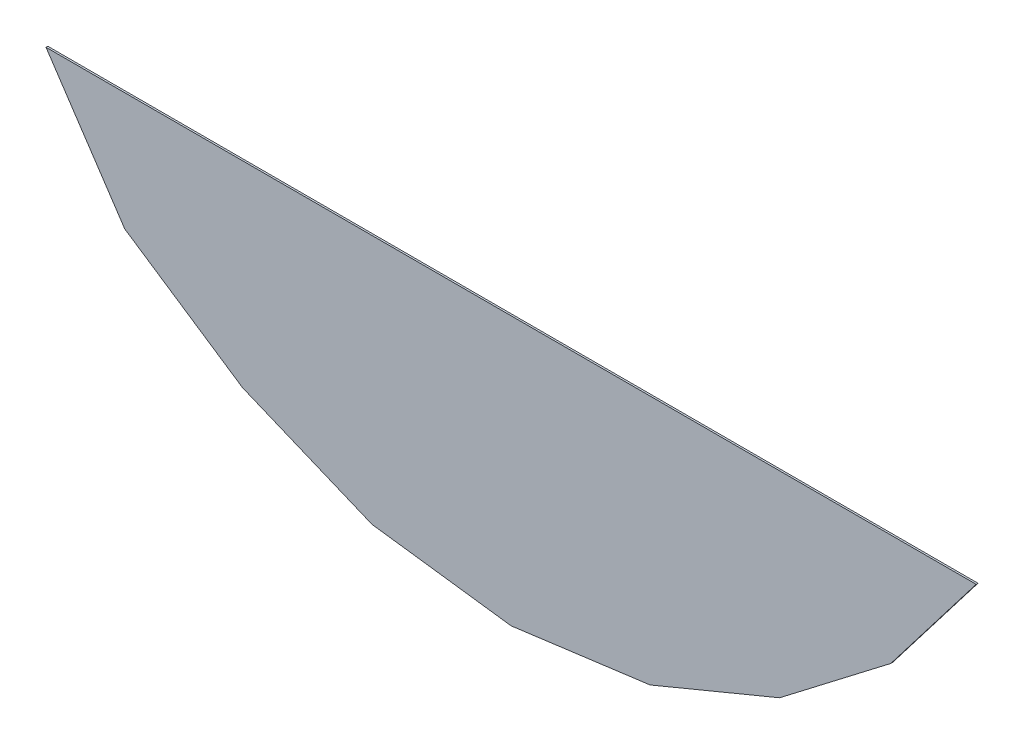
ISO-10303-21;
HEADER;
FILE_DESCRIPTION(('STEP AP214'),'2;1');
FILE_NAME('part.step','',(''),(''),'','','');
FILE_SCHEMA(('AUTOMOTIVE_DESIGN { 1 0 10303 214 1 1 1 1 }'));
ENDSEC;
DATA;
#1=APPLICATION_CONTEXT('core data for automotive mechanical design processes');
#2=APPLICATION_PROTOCOL_DEFINITION('international standard','automotive_design',2000,#1);
#3=PRODUCT_CONTEXT('',#1,'mechanical');
#4=PRODUCT('Part','Part','',(#3));
#5=PRODUCT_RELATED_PRODUCT_CATEGORY('part','',(#4));
#6=PRODUCT_DEFINITION_FORMATION('','',#4);
#7=PRODUCT_DEFINITION_CONTEXT('part definition',#1,'design');
#8=PRODUCT_DEFINITION('design','',#6,#7);
#9=PRODUCT_DEFINITION_SHAPE('','',#8);
#10=(LENGTH_UNIT() NAMED_UNIT(*) SI_UNIT(.MILLI.,.METRE.));
#11=(NAMED_UNIT(*) PLANE_ANGLE_UNIT() SI_UNIT($,.RADIAN.));
#12=(NAMED_UNIT(*) SI_UNIT($,.STERADIAN.) SOLID_ANGLE_UNIT());
#13=UNCERTAINTY_MEASURE_WITH_UNIT(LENGTH_MEASURE(1.E-05),#10,'distance_accuracy_value','');
#14=(GEOMETRIC_REPRESENTATION_CONTEXT(3) GLOBAL_UNCERTAINTY_ASSIGNED_CONTEXT((#13)) GLOBAL_UNIT_ASSIGNED_CONTEXT((#10,
#11,#12)) REPRESENTATION_CONTEXT('',''));
#15=CARTESIAN_POINT('',(0.,0.,0.));
#16=DIRECTION('',(0.,0.,1.));
#17=DIRECTION('',(1.,0.,0.));
#18=AXIS2_PLACEMENT_3D('',#15,#16,#17);
#19=CARTESIAN_POINT('',(-2.55477772,-4.28920148,3.89999982));
#20=DIRECTION('',(0.,0.,1.));
#21=DIRECTION('',(1.,0.,0.));
#22=AXIS2_PLACEMENT_3D('',#19,#20,#21);
#23=PLANE('',#22);
#24=DIRECTION('',(0.793354187267815,0.608760325205762,0.));
#25=VECTOR('',#24,1.);
#26=CARTESIAN_POINT('',(1.47499832000001,-5.36897580000001,3.89999982));
#27=LINE('',#26,#25);
#28=CARTESIAN_POINT('',(1.47499832000001,-5.36897580000002,3.89999982));
#29=VERTEX_POINT('',#28);
#30=CARTESIAN_POINT('',(2.08596230000003,-4.90016800000002,3.89999982));
#31=VERTEX_POINT('',#30);
#32=EDGE_CURVE('E116',#29,#31,#27,.T.);
#33=ORIENTED_EDGE('',*,*,#32,.F.);
#34=DIRECTION('',(0.923879753352726,0.382682899206258,0.));
#35=VECTOR('',#34,1.);
#36=CARTESIAN_POINT('',(0.763513839999964,-5.66368183999992,3.89999982));
#37=LINE('',#36,#35);
#38=CARTESIAN_POINT('',(0.763513839999939,-5.66368183999988,3.89999982));
#39=VERTEX_POINT('',#38);
#40=EDGE_CURVE('E114',#39,#29,#37,.T.);
#41=ORIENTED_EDGE('',*,*,#40,.F.);
#42=DIRECTION('',(0.991445008976763,0.130525071059419,0.));
#43=VECTOR('',#42,1.);
#44=CARTESIAN_POINT('',(-2.54000000806526E-06,-5.76419979999992,3.89999982));
#45=LINE('',#44,#43);
#46=CARTESIAN_POINT('',(-2.54000002030564E-06,-5.76419979999987,3.89999982));
#47=VERTEX_POINT('',#46);
#48=EDGE_CURVE('E112',#47,#39,#45,.T.);
#49=ORIENTED_EDGE('',*,*,#48,.F.);
#50=DIRECTION('',(0.991445008976791,-0.130525071059209,0.));
#51=VECTOR('',#50,1.);
#52=CARTESIAN_POINT('',(-0.763518920000012,-5.66368184000008,3.89999982));
#53=LINE('',#52,#51);
#54=CARTESIAN_POINT('',(-0.763518920000012,-5.66368184000013,3.89999982));
#55=VERTEX_POINT('',#54);
#56=EDGE_CURVE('E108',#55,#47,#53,.T.);
#57=ORIENTED_EDGE('',*,*,#56,.F.);
#58=DIRECTION('',(0.923879753352681,-0.382682899206366,0.));
#59=VECTOR('',#58,1.);
#60=CARTESIAN_POINT('',(-1.47500340000004,-5.36897580000008,3.89999982));
#61=LINE('',#60,#59);
#62=CARTESIAN_POINT('',(-1.47500340000005,-5.36897580000012,3.89999982));
#63=VERTEX_POINT('',#62);
#64=EDGE_CURVE('E107',#63,#55,#61,.T.);
#65=ORIENTED_EDGE('',*,*,#64,.F.);
#66=DIRECTION('',(0.831757058894327,-0.555139797690148,0.));
#67=VECTOR('',#66,1.);
#68=CARTESIAN_POINT('',(-2.12257131999998,-4.93676939999997,3.89999982));
#69=LINE('',#68,#67);
#70=CARTESIAN_POINT('',(-2.12257131999997,-4.93676939999995,3.89999982));
#71=VERTEX_POINT('',#70);
#72=EDGE_CURVE('E85',#71,#63,#69,.T.);
#73=ORIENTED_EDGE('',*,*,#72,.F.);
#74=DIRECTION('',(0.555139797690141,-0.831757058894332,0.));
#75=VECTOR('',#74,1.);
#76=CARTESIAN_POINT('',(-2.55477772000007,-4.28920148000005,3.89999982));
#77=LINE('',#76,#75);
#78=CARTESIAN_POINT('',(-2.5547777200001,-4.28920148000002,3.89999982));
#79=VERTEX_POINT('',#78);
#80=EDGE_CURVE('E20',#79,#71,#77,.T.);
#81=ORIENTED_EDGE('',*,*,#80,.F.);
#82=DIRECTION('',(1.,0.,0.));
#83=VECTOR('',#82,1.);
#84=CARTESIAN_POINT('',(-2.55477772,-4.28920148,3.89999982));
#85=LINE('',#84,#83);
#86=CARTESIAN_POINT('',(2.55477264,-4.28920148,3.89999982));
#87=VERTEX_POINT('',#86);
#88=EDGE_CURVE('E123',#87,#79,#85,.F.);
#89=ORIENTED_EDGE('',*,*,#88,.F.);
#90=DIRECTION('',(0.608760808228314,0.793353816632409,0.));
#91=VECTOR('',#90,1.);
#92=CARTESIAN_POINT('',(2.55477264,-4.28920148,3.89999982));
#93=LINE('',#92,#91);
#94=EDGE_CURVE('E118',#31,#87,#93,.T.);
#95=ORIENTED_EDGE('',*,*,#94,.F.);
#96=EDGE_LOOP('',(#33,#41,#49,#57,#65,#73,#81,#89,#95));
#97=FACE_BOUND('',#96,.T.);
#98=ADVANCED_FACE('F17',(#97),#23,.F.);
#99=CARTESIAN_POINT('',(2.55477264,-4.28920148,3.89999982));
#100=DIRECTION('',(0.793353816632409,-0.608760808228314,0.));
#101=DIRECTION('',(0.608760808228314,0.793353816632409,0.));
#102=AXIS2_PLACEMENT_3D('',#99,#100,#101);
#103=PLANE('',#102);
#104=DIRECTION('',(0.,0.,1.));
#105=VECTOR('',#104,1.);
#106=CARTESIAN_POINT('',(2.55477264,-4.28920148,3.89999982));
#107=LINE('',#106,#105);
#108=CARTESIAN_POINT('',(2.55477264,-4.28920148,3.9099998));
#109=VERTEX_POINT('',#108);
#110=EDGE_CURVE('E120',#109,#87,#107,.F.);
#111=ORIENTED_EDGE('',*,*,#110,.F.);
#112=DIRECTION('',(0.608760808228391,0.79335381663235,0.));
#113=VECTOR('',#112,1.);
#114=CARTESIAN_POINT('',(2.08596230000002,-4.90016800000001,3.9099998));
#115=LINE('',#114,#113);
#116=CARTESIAN_POINT('',(2.08596230000005,-4.90016800000003,3.9099998));
#117=VERTEX_POINT('',#116);
#118=EDGE_CURVE('E140',#117,#109,#115,.T.);
#119=ORIENTED_EDGE('',*,*,#118,.F.);
#120=DIRECTION('',(0.,0.,1.));
#121=VECTOR('',#120,1.);
#122=CARTESIAN_POINT('',(2.08596230000001,-4.90016799999999,3.89999982));
#123=LINE('',#122,#121);
#124=EDGE_CURVE('E137',#31,#117,#123,.T.);
#125=ORIENTED_EDGE('',*,*,#124,.F.);
#126=ORIENTED_EDGE('',*,*,#94,.T.);
#127=EDGE_LOOP('',(#111,#119,#125,#126));
#128=FACE_BOUND('',#127,.T.);
#129=ADVANCED_FACE('F171',(#128),#103,.T.);
#130=CARTESIAN_POINT('',(-2.55477772,-4.28920148,3.89999982));
#131=DIRECTION('',(0.,1.,0.));
#132=DIRECTION('',(0.,0.,1.));
#133=AXIS2_PLACEMENT_3D('',#130,#131,#132);
#134=PLANE('',#133);
#135=DIRECTION('',(0.,0.,1.));
#136=VECTOR('',#135,1.);
#137=CARTESIAN_POINT('',(-2.55477772000014,-4.2892014800001,3.89999982));
#138=LINE('',#137,#136);
#139=CARTESIAN_POINT('',(-2.5547777200001,-4.28920148000002,3.9099998));
#140=VERTEX_POINT('',#139);
#141=EDGE_CURVE('E94',#140,#79,#138,.F.);
#142=ORIENTED_EDGE('',*,*,#141,.F.);
#143=DIRECTION('',(1.,0.,0.));
#144=VECTOR('',#143,1.);
#145=CARTESIAN_POINT('',(-2.55477772,-4.28920148,3.9099998));
#146=LINE('',#145,#144);
#147=EDGE_CURVE('E143',#109,#140,#146,.F.);
#148=ORIENTED_EDGE('',*,*,#147,.F.);
#149=ORIENTED_EDGE('',*,*,#110,.T.);
#150=ORIENTED_EDGE('',*,*,#88,.T.);
#151=EDGE_LOOP('',(#142,#148,#149,#150));
#152=FACE_BOUND('',#151,.T.);
#153=ADVANCED_FACE('F174',(#152),#134,.T.);
#154=CARTESIAN_POINT('',(-2.12257132,-4.9367694,3.89999982));
#155=DIRECTION('',(-0.831757058894295,-0.555139797690197,0.));
#156=DIRECTION('',(0.555139797690197,-0.831757058894295,0.));
#157=AXIS2_PLACEMENT_3D('',#154,#155,#156);
#158=PLANE('',#157);
#159=DIRECTION('',(0.,0.,1.));
#160=VECTOR('',#159,1.);
#161=CARTESIAN_POINT('',(-2.12257131999991,-4.93676939999986,3.89999982));
#162=LINE('',#161,#160);
#163=CARTESIAN_POINT('',(-2.12257131999998,-4.93676939999995,3.9099998));
#164=VERTEX_POINT('',#163);
#165=EDGE_CURVE('E92',#164,#71,#162,.F.);
#166=ORIENTED_EDGE('',*,*,#165,.F.);
#167=DIRECTION('',(0.555139797690141,-0.831757058894332,0.));
#168=VECTOR('',#167,1.);
#169=CARTESIAN_POINT('',(-2.55477772000007,-4.28920148000005,3.9099998));
#170=LINE('',#169,#168);
#171=EDGE_CURVE('E146',#140,#164,#170,.T.);
#172=ORIENTED_EDGE('',*,*,#171,.F.);
#173=ORIENTED_EDGE('',*,*,#141,.T.);
#174=ORIENTED_EDGE('',*,*,#80,.T.);
#175=EDGE_LOOP('',(#166,#172,#173,#174));
#176=FACE_BOUND('',#175,.T.);
#177=ADVANCED_FACE('F90',(#176),#158,.T.);
#178=CARTESIAN_POINT('',(-1.4750034,-5.3689758,3.89999982));
#179=DIRECTION('',(-0.555139797690197,-0.831757058894295,0.));
#180=DIRECTION('',(0.831757058894295,-0.555139797690197,0.));
#181=AXIS2_PLACEMENT_3D('',#178,#179,#180);
#182=PLANE('',#181);
#183=DIRECTION('',(0.,0.,1.));
#184=VECTOR('',#183,1.);
#185=CARTESIAN_POINT('',(-1.47500340000015,-5.36897580000034,3.89999982));
#186=LINE('',#185,#184);
#187=CARTESIAN_POINT('',(-1.47500340000004,-5.36897580000011,3.9099998));
#188=VERTEX_POINT('',#187);
#189=EDGE_CURVE('E102',#188,#63,#186,.F.);
#190=ORIENTED_EDGE('',*,*,#189,.F.);
#191=DIRECTION('',(0.831757058894327,-0.555139797690148,0.));
#192=VECTOR('',#191,1.);
#193=CARTESIAN_POINT('',(-2.12257131999998,-4.93676939999997,3.9099998));
#194=LINE('',#193,#192);
#195=EDGE_CURVE('E100',#164,#188,#194,.T.);
#196=ORIENTED_EDGE('',*,*,#195,.F.);
#197=ORIENTED_EDGE('',*,*,#165,.T.);
#198=ORIENTED_EDGE('',*,*,#72,.T.);
#199=EDGE_LOOP('',(#190,#196,#197,#198));
#200=FACE_BOUND('',#199,.T.);
#201=ADVANCED_FACE('F98',(#200),#182,.T.);
#202=CARTESIAN_POINT('',(-0.76351892,-5.66368184,3.89999982));
#203=DIRECTION('',(-0.382682899205941,-0.923879753352857,0.));
#204=DIRECTION('',(0.923879753352857,-0.382682899205941,0.));
#205=AXIS2_PLACEMENT_3D('',#202,#203,#204);
#206=PLANE('',#205);
#207=DIRECTION('',(0.,0.,1.));
#208=VECTOR('',#207,1.);
#209=CARTESIAN_POINT('',(-0.763518920000046,-5.66368184000034,3.89999982));
#210=LINE('',#209,#208);
#211=CARTESIAN_POINT('',(-0.763518920000005,-5.66368184000011,3.9099998));
#212=VERTEX_POINT('',#211);
#213=EDGE_CURVE('E127',#212,#55,#210,.F.);
#214=ORIENTED_EDGE('',*,*,#213,.F.);
#215=DIRECTION('',(0.923879753352681,-0.382682899206366,0.));
#216=VECTOR('',#215,1.);
#217=CARTESIAN_POINT('',(-1.47500340000004,-5.36897580000008,3.9099998));
#218=LINE('',#217,#216);
#219=EDGE_CURVE('E149',#188,#212,#218,.T.);
#220=ORIENTED_EDGE('',*,*,#219,.F.);
#221=ORIENTED_EDGE('',*,*,#189,.T.);
#222=ORIENTED_EDGE('',*,*,#64,.T.);
#223=EDGE_LOOP('',(#214,#220,#221,#222));
#224=FACE_BOUND('',#223,.T.);
#225=ADVANCED_FACE('F198',(#224),#206,.T.);
#226=CARTESIAN_POINT('',(-2.539999996998E-06,-5.7641998,3.89999982));
#227=DIRECTION('',(-0.130525071058976,-0.991445008976821,0.));
#228=DIRECTION('',(0.991445008976821,-0.130525071058976,0.));
#229=AXIS2_PLACEMENT_3D('',#226,#227,#228);
#230=PLANE('',#229);
#231=DIRECTION('',(0.,0.,1.));
#232=VECTOR('',#231,1.);
#233=CARTESIAN_POINT('',(-2.54000004210921E-06,-5.76419979999966,3.89999982));
#234=LINE('',#233,#232);
#235=CARTESIAN_POINT('',(-2.54000002226133E-06,-5.76419979999989,3.9099998));
#236=VERTEX_POINT('',#235);
#237=EDGE_CURVE('E130',#236,#47,#234,.F.);
#238=ORIENTED_EDGE('',*,*,#237,.F.);
#239=DIRECTION('',(0.991445008976791,-0.130525071059209,0.));
#240=VECTOR('',#239,1.);
#241=CARTESIAN_POINT('',(-0.763518920000012,-5.66368184000008,3.9099998));
#242=LINE('',#241,#240);
#243=EDGE_CURVE('E152',#212,#236,#242,.T.);
#244=ORIENTED_EDGE('',*,*,#243,.F.);
#245=ORIENTED_EDGE('',*,*,#213,.T.);
#246=ORIENTED_EDGE('',*,*,#56,.T.);
#247=EDGE_LOOP('',(#238,#244,#245,#246));
#248=FACE_BOUND('',#247,.T.);
#249=ADVANCED_FACE('F195',(#248),#230,.T.);
#250=CARTESIAN_POINT('',(0.76351384,-5.66368184,3.89999982));
#251=DIRECTION('',(0.130525071058976,-0.991445008976821,0.));
#252=DIRECTION('',(0.991445008976821,0.130525071058976,0.));
#253=AXIS2_PLACEMENT_3D('',#250,#251,#252);
#254=PLANE('',#253);
#255=DIRECTION('',(0.,0.,1.));
#256=VECTOR('',#255,1.);
#257=CARTESIAN_POINT('',(0.763513839999858,-5.66368183999966,3.89999982));
#258=LINE('',#257,#256);
#259=CARTESIAN_POINT('',(0.763513839999943,-5.6636818399999,3.9099998));
#260=VERTEX_POINT('',#259);
#261=EDGE_CURVE('E133',#260,#39,#258,.F.);
#262=ORIENTED_EDGE('',*,*,#261,.F.);
#263=DIRECTION('',(0.991445008976763,0.130525071059419,0.));
#264=VECTOR('',#263,1.);
#265=CARTESIAN_POINT('',(-2.54000000806526E-06,-5.76419979999992,3.9099998));
#266=LINE('',#265,#264);
#267=EDGE_CURVE('E155',#236,#260,#266,.T.);
#268=ORIENTED_EDGE('',*,*,#267,.F.);
#269=ORIENTED_EDGE('',*,*,#237,.T.);
#270=ORIENTED_EDGE('',*,*,#48,.T.);
#271=EDGE_LOOP('',(#262,#268,#269,#270));
#272=FACE_BOUND('',#271,.T.);
#273=ADVANCED_FACE('F192',(#272),#254,.T.);
#274=CARTESIAN_POINT('',(1.47499832,-5.3689758,3.89999982));
#275=DIRECTION('',(0.382682899205941,-0.923879753352857,0.));
#276=DIRECTION('',(0.923879753352857,0.382682899205941,0.));
#277=AXIS2_PLACEMENT_3D('',#274,#275,#276);
#278=PLANE('',#277);
#279=DIRECTION('',(0.,0.,1.));
#280=VECTOR('',#279,1.);
#281=CARTESIAN_POINT('',(1.47499832000003,-5.36897580000004,3.89999982));
#282=LINE('',#281,#280);
#283=CARTESIAN_POINT('',(1.47499832000001,-5.36897580000001,3.9099998));
#284=VERTEX_POINT('',#283);
#285=EDGE_CURVE('E35',#284,#29,#282,.F.);
#286=ORIENTED_EDGE('',*,*,#285,.F.);
#287=DIRECTION('',(0.923879753352726,0.382682899206258,0.));
#288=VECTOR('',#287,1.);
#289=CARTESIAN_POINT('',(0.763513839999964,-5.66368183999992,3.9099998));
#290=LINE('',#289,#288);
#291=EDGE_CURVE('E26',#260,#284,#290,.T.);
#292=ORIENTED_EDGE('',*,*,#291,.F.);
#293=ORIENTED_EDGE('',*,*,#261,.T.);
#294=ORIENTED_EDGE('',*,*,#40,.T.);
#295=EDGE_LOOP('',(#286,#292,#293,#294));
#296=FACE_BOUND('',#295,.T.);
#297=ADVANCED_FACE('F162',(#296),#278,.T.);
#298=CARTESIAN_POINT('',(2.0859623,-4.900168,3.89999982));
#299=DIRECTION('',(0.608760325205822,-0.793354187267769,0.));
#300=DIRECTION('',(0.793354187267769,0.608760325205822,0.));
#301=AXIS2_PLACEMENT_3D('',#298,#299,#300);
#302=PLANE('',#301);
#303=ORIENTED_EDGE('',*,*,#124,.T.);
#304=DIRECTION('',(0.793354187267815,0.608760325205762,0.));
#305=VECTOR('',#304,1.);
#306=CARTESIAN_POINT('',(1.47499832000001,-5.36897580000001,3.9099998));
#307=LINE('',#306,#305);
#308=EDGE_CURVE('E11',#284,#117,#307,.T.);
#309=ORIENTED_EDGE('',*,*,#308,.F.);
#310=ORIENTED_EDGE('',*,*,#285,.T.);
#311=ORIENTED_EDGE('',*,*,#32,.T.);
#312=EDGE_LOOP('',(#303,#309,#310,#311));
#313=FACE_BOUND('',#312,.T.);
#314=ADVANCED_FACE('F169',(#313),#302,.T.);
#315=CARTESIAN_POINT('',(-2.55477772,-4.28920148,3.9099998));
#316=DIRECTION('',(0.,0.,1.));
#317=DIRECTION('',(1.,0.,0.));
#318=AXIS2_PLACEMENT_3D('',#315,#316,#317);
#319=PLANE('',#318);
#320=ORIENTED_EDGE('',*,*,#291,.T.);
#321=ORIENTED_EDGE('',*,*,#308,.T.);
#322=ORIENTED_EDGE('',*,*,#118,.T.);
#323=ORIENTED_EDGE('',*,*,#147,.T.);
#324=ORIENTED_EDGE('',*,*,#171,.T.);
#325=ORIENTED_EDGE('',*,*,#195,.T.);
#326=ORIENTED_EDGE('',*,*,#219,.T.);
#327=ORIENTED_EDGE('',*,*,#243,.T.);
#328=ORIENTED_EDGE('',*,*,#267,.T.);
#329=EDGE_LOOP('',(#320,#321,#322,#323,#324,#325,#326,#327,#328));
#330=FACE_BOUND('',#329,.T.);
#331=ADVANCED_FACE('F160',(#330),#319,.T.);
#332=CLOSED_SHELL('',(#98,#129,#153,#177,#201,#225,#249,#273,#297,#314,#331));
#333=MANIFOLD_SOLID_BREP('B1',#332);
#334=ADVANCED_BREP_SHAPE_REPRESENTATION('',(#18,#333),#14);
#335=SHAPE_DEFINITION_REPRESENTATION(#9,#334);
ENDSEC;
END-ISO-10303-21;
